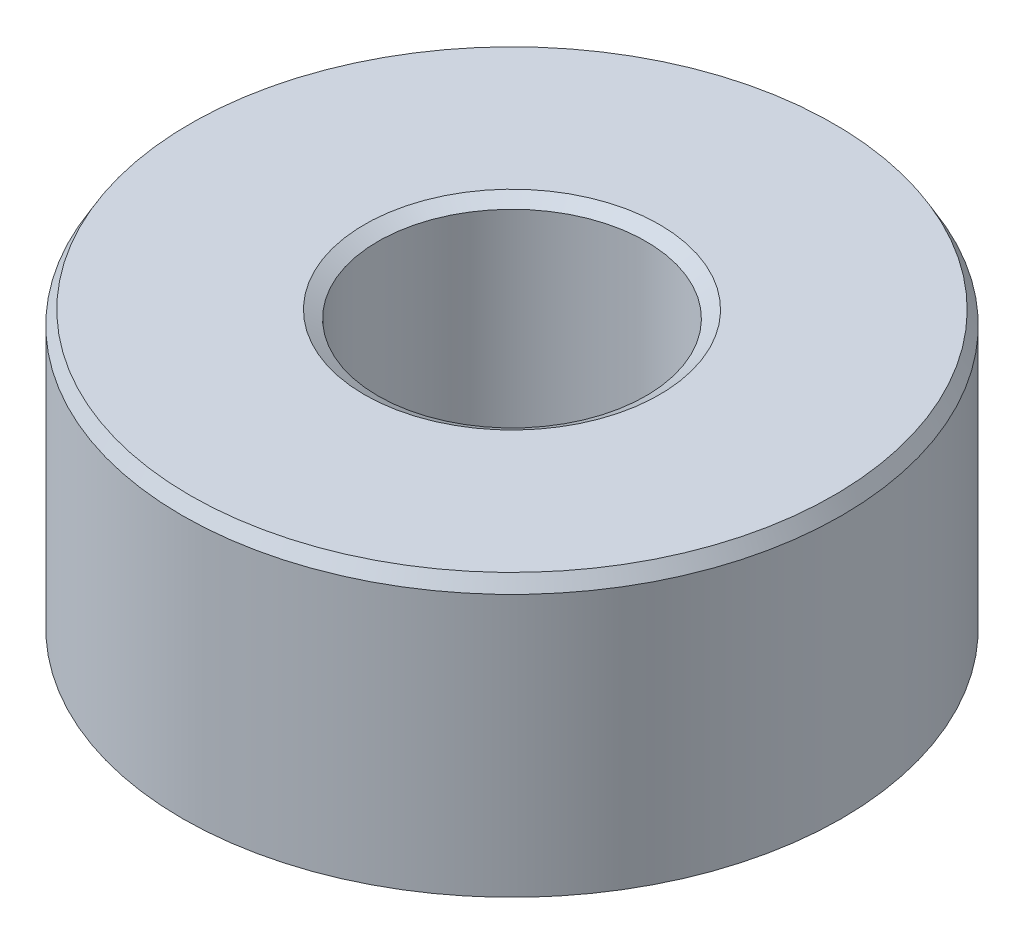
ISO-10303-21;
HEADER;
FILE_DESCRIPTION(('STEP AP214'),'2;1');
FILE_NAME('part.step','',(''),(''),'','','');
FILE_SCHEMA(('AUTOMOTIVE_DESIGN { 1 0 10303 214 1 1 1 1 }'));
ENDSEC;
DATA;
#1=APPLICATION_CONTEXT('core data for automotive mechanical design processes');
#2=APPLICATION_PROTOCOL_DEFINITION('international standard','automotive_design',2000,#1);
#3=PRODUCT_CONTEXT('',#1,'mechanical');
#4=PRODUCT('Part','Part','',(#3));
#5=PRODUCT_RELATED_PRODUCT_CATEGORY('part','',(#4));
#6=PRODUCT_DEFINITION_FORMATION('','',#4);
#7=PRODUCT_DEFINITION_CONTEXT('part definition',#1,'design');
#8=PRODUCT_DEFINITION('design','',#6,#7);
#9=PRODUCT_DEFINITION_SHAPE('','',#8);
#10=(LENGTH_UNIT() NAMED_UNIT(*) SI_UNIT(.MILLI.,.METRE.));
#11=(NAMED_UNIT(*) PLANE_ANGLE_UNIT() SI_UNIT($,.RADIAN.));
#12=(NAMED_UNIT(*) SI_UNIT($,.STERADIAN.) SOLID_ANGLE_UNIT());
#13=UNCERTAINTY_MEASURE_WITH_UNIT(LENGTH_MEASURE(1.E-05),#10,'distance_accuracy_value','');
#14=(GEOMETRIC_REPRESENTATION_CONTEXT(3) GLOBAL_UNCERTAINTY_ASSIGNED_CONTEXT((#13)) GLOBAL_UNIT_ASSIGNED_CONTEXT((#10,
#11,#12)) REPRESENTATION_CONTEXT('',''));
#15=CARTESIAN_POINT('',(0.,0.,0.));
#16=DIRECTION('',(0.,0.,1.));
#17=DIRECTION('',(1.,0.,0.));
#18=AXIS2_PLACEMENT_3D('',#15,#16,#17);
#19=CARTESIAN_POINT('',(0.,51.6246455643637,0.));
#20=DIRECTION('',(0.,-1.,0.));
#21=DIRECTION('',(0.,0.,-1.));
#22=AXIS2_PLACEMENT_3D('',#19,#20,#21);
#23=CYLINDRICAL_SURFACE('',#22,60.);
#24=CARTESIAN_POINT('',(0.,1.42212574048441,0.));
#25=DIRECTION('',(0.,1.,0.));
#26=DIRECTION('',(0.,0.,1.));
#27=AXIS2_PLACEMENT_3D('',#24,#25,#26);
#28=CIRCLE('',#27,60.);
#29=CARTESIAN_POINT('',(0.,1.42212574048441,60.));
#30=VERTEX_POINT('',#29);
#31=EDGE_CURVE('E10',#30,#30,#28,.T.);
#32=ORIENTED_EDGE('',*,*,#31,.T.);
#33=EDGE_LOOP('',(#32));
#34=FACE_BOUND('',#33,.T.);
#35=CARTESIAN_POINT('',(0.,49.1614515270932,0.));
#36=DIRECTION('',(0.,1.,0.));
#37=DIRECTION('',(0.,0.,1.));
#38=AXIS2_PLACEMENT_3D('',#35,#36,#37);
#39=CIRCLE('',#38,60.);
#40=CARTESIAN_POINT('',(0.,49.1614515270932,60.));
#41=VERTEX_POINT('',#40);
#42=EDGE_CURVE('E50',#41,#41,#39,.F.);
#43=ORIENTED_EDGE('',*,*,#42,.T.);
#44=EDGE_LOOP('',(#43));
#45=FACE_BOUND('',#44,.T.);
#46=ADVANCED_FACE('F39',(#34,#45),#23,.T.);
#47=CARTESIAN_POINT('',(0.,51.6246455643637,0.));
#48=DIRECTION('',(0.,1.,0.));
#49=DIRECTION('',(0.,0.,1.));
#50=AXIS2_PLACEMENT_3D('',#47,#48,#49);
#51=PLANE('',#50);
#52=CARTESIAN_POINT('',(0.,51.6246455643637,0.));
#53=DIRECTION('',(0.,1.,0.));
#54=DIRECTION('',(0.,0.,1.));
#55=AXIS2_PLACEMENT_3D('',#52,#53,#54);
#56=CIRCLE('',#55,26.8412994018472);
#57=CARTESIAN_POINT('',(0.,51.6246455643637,26.8412994018472));
#58=VERTEX_POINT('',#57);
#59=EDGE_CURVE('E58',#58,#58,#56,.F.);
#60=ORIENTED_EDGE('',*,*,#59,.T.);
#61=EDGE_LOOP('',(#60));
#62=FACE_BOUND('',#61,.T.);
#63=CARTESIAN_POINT('',(0.,51.6246455643637,0.));
#64=DIRECTION('',(0.,1.,0.));
#65=DIRECTION('',(0.,0.,1.));
#66=AXIS2_PLACEMENT_3D('',#63,#64,#65);
#67=CIRCLE('',#66,58.5778742595156);
#68=CARTESIAN_POINT('',(0.,51.6246455643637,58.5778742595156));
#69=VERTEX_POINT('',#68);
#70=EDGE_CURVE('E61',#69,#69,#67,.T.);
#71=ORIENTED_EDGE('',*,*,#70,.T.);
#72=EDGE_LOOP('',(#71));
#73=FACE_BOUND('',#72,.T.);
#74=ADVANCED_FACE('F88',(#62,#73),#51,.T.);
#75=CARTESIAN_POINT('',(0.,0.,0.));
#76=DIRECTION('',(0.,1.,0.));
#77=DIRECTION('',(0.,0.,1.));
#78=AXIS2_PLACEMENT_3D('',#75,#76,#77);
#79=PLANE('',#78);
#80=CARTESIAN_POINT('',(0.,0.,0.));
#81=DIRECTION('',(0.,1.,0.));
#82=DIRECTION('',(0.,0.,1.));
#83=AXIS2_PLACEMENT_3D('',#80,#81,#82);
#84=CIRCLE('',#83,25.800231105061);
#85=CARTESIAN_POINT('',(0.,0.,25.800231105061));
#86=VERTEX_POINT('',#85);
#87=EDGE_CURVE('E51',#86,#86,#84,.T.);
#88=ORIENTED_EDGE('',*,*,#87,.T.);
#89=EDGE_LOOP('',(#88));
#90=FACE_BOUND('',#89,.T.);
#91=CARTESIAN_POINT('',(0.,0.,0.));
#92=DIRECTION('',(0.,1.,0.));
#93=DIRECTION('',(0.,0.,1.));
#94=AXIS2_PLACEMENT_3D('',#91,#92,#93);
#95=CIRCLE('',#94,57.5368059627295);
#96=CARTESIAN_POINT('',(0.,0.,57.5368059627295));
#97=VERTEX_POINT('',#96);
#98=EDGE_CURVE('E54',#97,#97,#95,.F.);
#99=ORIENTED_EDGE('',*,*,#98,.T.);
#100=EDGE_LOOP('',(#99));
#101=FACE_BOUND('',#100,.T.);
#102=ADVANCED_FACE('F83',(#90,#101),#79,.F.);
#103=CARTESIAN_POINT('',(0.,51.6246455643637,0.));
#104=DIRECTION('',(0.,-1.,0.));
#105=DIRECTION('',(0.,0.,-1.));
#106=AXIS2_PLACEMENT_3D('',#103,#104,#105);
#107=CYLINDRICAL_SURFACE('',#106,24.3781053645766);
#108=CARTESIAN_POINT('',(0.,50.2025198238793,0.));
#109=DIRECTION('',(0.,1.,0.));
#110=DIRECTION('',(0.,0.,1.));
#111=AXIS2_PLACEMENT_3D('',#108,#109,#110);
#112=CIRCLE('',#111,24.3781053645766);
#113=CARTESIAN_POINT('',(0.,50.2025198238793,24.3781053645766));
#114=VERTEX_POINT('',#113);
#115=EDGE_CURVE('E67',#114,#114,#112,.T.);
#116=ORIENTED_EDGE('',*,*,#115,.T.);
#117=EDGE_LOOP('',(#116));
#118=FACE_BOUND('',#117,.T.);
#119=CARTESIAN_POINT('',(0.,2.46319403727048,0.));
#120=DIRECTION('',(0.,1.,0.));
#121=DIRECTION('',(0.,0.,1.));
#122=AXIS2_PLACEMENT_3D('',#119,#120,#121);
#123=CIRCLE('',#122,24.3781053645766);
#124=CARTESIAN_POINT('',(0.,2.46319403727048,24.3781053645766));
#125=VERTEX_POINT('',#124);
#126=EDGE_CURVE('E69',#125,#125,#123,.F.);
#127=ORIENTED_EDGE('',*,*,#126,.T.);
#128=EDGE_LOOP('',(#127));
#129=FACE_BOUND('',#128,.T.);
#130=ADVANCED_FACE('F71',(#118,#129),#107,.F.);
#131=CARTESIAN_POINT('',(0.,50.2025198238793,0.));
#132=DIRECTION('',(0.,1.,0.));
#133=DIRECTION('',(0.,0.,1.));
#134=AXIS2_PLACEMENT_3D('',#131,#132,#133);
#135=CONICAL_SURFACE('',#134,24.3781053645766,1.0471975511966);
#136=ORIENTED_EDGE('',*,*,#59,.F.);
#137=EDGE_LOOP('',(#136));
#138=FACE_BOUND('',#137,.T.);
#139=ORIENTED_EDGE('',*,*,#115,.F.);
#140=EDGE_LOOP('',(#139));
#141=FACE_BOUND('',#140,.T.);
#142=ADVANCED_FACE('F77',(#138,#141),#135,.F.);
#143=CARTESIAN_POINT('',(0.,0.,0.));
#144=DIRECTION('',(0.,-1.,0.));
#145=DIRECTION('',(0.,0.,-1.));
#146=AXIS2_PLACEMENT_3D('',#143,#144,#145);
#147=CONICAL_SURFACE('',#146,25.800231105061,0.523598775598299);
#148=ORIENTED_EDGE('',*,*,#126,.F.);
#149=EDGE_LOOP('',(#148));
#150=FACE_BOUND('',#149,.T.);
#151=ORIENTED_EDGE('',*,*,#87,.F.);
#152=EDGE_LOOP('',(#151));
#153=FACE_BOUND('',#152,.T.);
#154=ADVANCED_FACE('F73',(#150,#153),#147,.F.);
#155=CARTESIAN_POINT('',(0.,1.42212574048441,0.));
#156=DIRECTION('',(0.,1.,0.));
#157=DIRECTION('',(0.,0.,1.));
#158=AXIS2_PLACEMENT_3D('',#155,#156,#157);
#159=CONICAL_SURFACE('',#158,60.,1.0471975511966);
#160=ORIENTED_EDGE('',*,*,#98,.F.);
#161=EDGE_LOOP('',(#160));
#162=FACE_BOUND('',#161,.T.);
#163=ORIENTED_EDGE('',*,*,#31,.F.);
#164=EDGE_LOOP('',(#163));
#165=FACE_BOUND('',#164,.T.);
#166=ADVANCED_FACE('F76',(#162,#165),#159,.T.);
#167=CARTESIAN_POINT('',(0.,51.6246455643637,0.));
#168=DIRECTION('',(0.,-1.,0.));
#169=DIRECTION('',(0.,0.,-1.));
#170=AXIS2_PLACEMENT_3D('',#167,#168,#169);
#171=CONICAL_SURFACE('',#170,58.5778742595156,0.523598775598305);
#172=ORIENTED_EDGE('',*,*,#42,.F.);
#173=EDGE_LOOP('',(#172));
#174=FACE_BOUND('',#173,.T.);
#175=ORIENTED_EDGE('',*,*,#70,.F.);
#176=EDGE_LOOP('',(#175));
#177=FACE_BOUND('',#176,.T.);
#178=ADVANCED_FACE('F45',(#174,#177),#171,.T.);
#179=CLOSED_SHELL('',(#46,#74,#102,#130,#142,#154,#166,#178));
#180=MANIFOLD_SOLID_BREP('B2',#179);
#181=ADVANCED_BREP_SHAPE_REPRESENTATION('',(#18,#180),#14);
#182=SHAPE_DEFINITION_REPRESENTATION(#9,#181);
ENDSEC;
END-ISO-10303-21;
